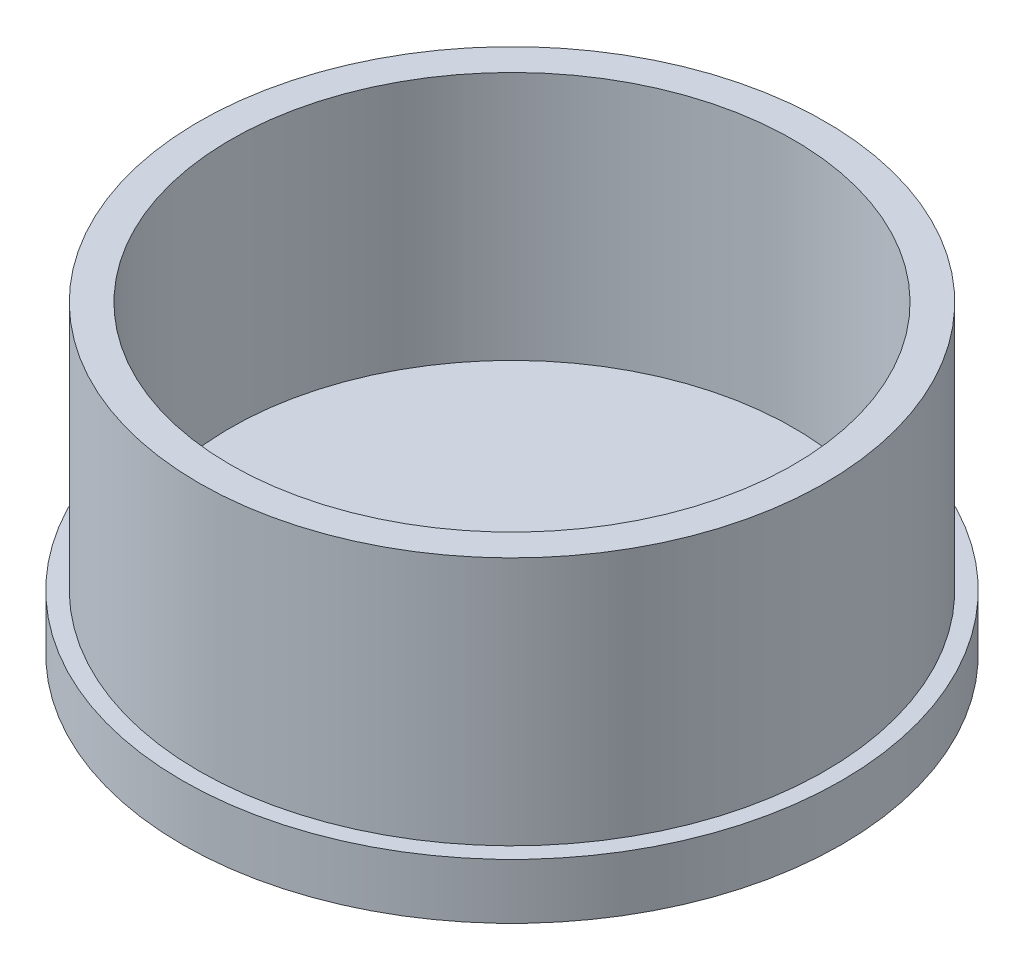
ISO-10303-21;
HEADER;
FILE_DESCRIPTION(('STEP AP214'),'2;1');
FILE_NAME('part.step','',(''),(''),'','','');
FILE_SCHEMA(('AUTOMOTIVE_DESIGN { 1 0 10303 214 1 1 1 1 }'));
ENDSEC;
DATA;
#1=APPLICATION_CONTEXT('core data for automotive mechanical design processes');
#2=APPLICATION_PROTOCOL_DEFINITION('international standard','automotive_design',2000,#1);
#3=PRODUCT_CONTEXT('',#1,'mechanical');
#4=PRODUCT('Part','Part','',(#3));
#5=PRODUCT_RELATED_PRODUCT_CATEGORY('part','',(#4));
#6=PRODUCT_DEFINITION_FORMATION('','',#4);
#7=PRODUCT_DEFINITION_CONTEXT('part definition',#1,'design');
#8=PRODUCT_DEFINITION('design','',#6,#7);
#9=PRODUCT_DEFINITION_SHAPE('','',#8);
#10=(LENGTH_UNIT() NAMED_UNIT(*) SI_UNIT(.MILLI.,.METRE.));
#11=(NAMED_UNIT(*) PLANE_ANGLE_UNIT() SI_UNIT($,.RADIAN.));
#12=(NAMED_UNIT(*) SI_UNIT($,.STERADIAN.) SOLID_ANGLE_UNIT());
#13=UNCERTAINTY_MEASURE_WITH_UNIT(LENGTH_MEASURE(1.E-05),#10,'distance_accuracy_value','');
#14=(GEOMETRIC_REPRESENTATION_CONTEXT(3) GLOBAL_UNCERTAINTY_ASSIGNED_CONTEXT((#13)) GLOBAL_UNIT_ASSIGNED_CONTEXT((#10,
#11,#12)) REPRESENTATION_CONTEXT('',''));
#15=CARTESIAN_POINT('',(0.,0.,0.));
#16=DIRECTION('',(0.,0.,1.));
#17=DIRECTION('',(1.,0.,0.));
#18=AXIS2_PLACEMENT_3D('',#15,#16,#17);
#19=CARTESIAN_POINT('',(0.,55.,0.));
#20=DIRECTION('',(0.,1.,0.));
#21=DIRECTION('',(0.,0.,1.));
#22=AXIS2_PLACEMENT_3D('',#19,#20,#21);
#23=PLANE('',#22);
#24=CARTESIAN_POINT('',(0.,55.,0.));
#25=DIRECTION('',(0.,1.,0.));
#26=DIRECTION('',(0.,0.,1.));
#27=AXIS2_PLACEMENT_3D('',#24,#25,#26);
#28=CIRCLE('',#27,50.8);
#29=CARTESIAN_POINT('',(0.,55.,50.8));
#30=VERTEX_POINT('',#29);
#31=EDGE_CURVE('E50',#30,#30,#28,.T.);
#32=ORIENTED_EDGE('',*,*,#31,.F.);
#33=EDGE_LOOP('',(#32));
#34=FACE_BOUND('',#33,.T.);
#35=CARTESIAN_POINT('',(0.,55.,0.));
#36=DIRECTION('',(0.,1.,0.));
#37=DIRECTION('',(0.,0.,1.));
#38=AXIS2_PLACEMENT_3D('',#35,#36,#37);
#39=CIRCLE('',#38,56.5);
#40=CARTESIAN_POINT('',(0.,55.,56.5));
#41=VERTEX_POINT('',#40);
#42=EDGE_CURVE('E62',#41,#41,#39,.T.);
#43=ORIENTED_EDGE('',*,*,#42,.T.);
#44=EDGE_LOOP('',(#43));
#45=FACE_BOUND('',#44,.T.);
#46=ADVANCED_FACE('F37',(#34,#45),#23,.T.);
#47=CARTESIAN_POINT('',(0.,10.,0.));
#48=DIRECTION('',(0.,1.,0.));
#49=DIRECTION('',(0.,0.,1.));
#50=AXIS2_PLACEMENT_3D('',#47,#48,#49);
#51=CYLINDRICAL_SURFACE('',#50,50.8);
#52=CARTESIAN_POINT('',(0.,10.,0.));
#53=DIRECTION('',(0.,1.,0.));
#54=DIRECTION('',(0.,0.,1.));
#55=AXIS2_PLACEMENT_3D('',#52,#53,#54);
#56=CIRCLE('',#55,50.8);
#57=CARTESIAN_POINT('',(0.,10.,50.8));
#58=VERTEX_POINT('',#57);
#59=EDGE_CURVE('E45',#58,#58,#56,.T.);
#60=ORIENTED_EDGE('',*,*,#59,.F.);
#61=EDGE_LOOP('',(#60));
#62=FACE_BOUND('',#61,.T.);
#63=ORIENTED_EDGE('',*,*,#31,.T.);
#64=EDGE_LOOP('',(#63));
#65=FACE_BOUND('',#64,.T.);
#66=ADVANCED_FACE('F87',(#62,#65),#51,.F.);
#67=CARTESIAN_POINT('',(0.,10.,0.));
#68=DIRECTION('',(0.,1.,0.));
#69=DIRECTION('',(0.,0.,1.));
#70=AXIS2_PLACEMENT_3D('',#67,#68,#69);
#71=PLANE('',#70);
#72=ORIENTED_EDGE('',*,*,#59,.T.);
#73=EDGE_LOOP('',(#72));
#74=FACE_BOUND('',#73,.T.);
#75=ADVANCED_FACE('F76',(#74),#71,.T.);
#76=CARTESIAN_POINT('',(0.,10.,0.));
#77=DIRECTION('',(0.,1.,0.));
#78=DIRECTION('',(0.,0.,1.));
#79=AXIS2_PLACEMENT_3D('',#76,#77,#78);
#80=PLANE('',#79);
#81=CARTESIAN_POINT('',(0.,10.,0.));
#82=DIRECTION('',(0.,1.,0.));
#83=DIRECTION('',(0.,0.,1.));
#84=AXIS2_PLACEMENT_3D('',#81,#82,#83);
#85=CIRCLE('',#84,56.5);
#86=CARTESIAN_POINT('',(0.,10.,56.5));
#87=VERTEX_POINT('',#86);
#88=EDGE_CURVE('E61',#87,#87,#85,.T.);
#89=ORIENTED_EDGE('',*,*,#88,.F.);
#90=EDGE_LOOP('',(#89));
#91=FACE_BOUND('',#90,.T.);
#92=CARTESIAN_POINT('',(0.,10.,0.));
#93=DIRECTION('',(0.,1.,0.));
#94=DIRECTION('',(0.,0.,1.));
#95=AXIS2_PLACEMENT_3D('',#92,#93,#94);
#96=CIRCLE('',#95,59.5);
#97=CARTESIAN_POINT('',(0.,10.,59.5));
#98=VERTEX_POINT('',#97);
#99=EDGE_CURVE('E56',#98,#98,#96,.T.);
#100=ORIENTED_EDGE('',*,*,#99,.T.);
#101=EDGE_LOOP('',(#100));
#102=FACE_BOUND('',#101,.T.);
#103=ADVANCED_FACE('F73',(#91,#102),#80,.T.);
#104=CARTESIAN_POINT('',(0.,10.,0.));
#105=DIRECTION('',(0.,1.,0.));
#106=DIRECTION('',(0.,0.,1.));
#107=AXIS2_PLACEMENT_3D('',#104,#105,#106);
#108=CYLINDRICAL_SURFACE('',#107,56.5);
#109=ORIENTED_EDGE('',*,*,#88,.T.);
#110=EDGE_LOOP('',(#109));
#111=FACE_BOUND('',#110,.T.);
#112=ORIENTED_EDGE('',*,*,#42,.F.);
#113=EDGE_LOOP('',(#112));
#114=FACE_BOUND('',#113,.T.);
#115=ADVANCED_FACE('F70',(#111,#114),#108,.T.);
#116=CARTESIAN_POINT('',(0.,0.,0.));
#117=DIRECTION('',(0.,1.,0.));
#118=DIRECTION('',(0.,0.,1.));
#119=AXIS2_PLACEMENT_3D('',#116,#117,#118);
#120=PLANE('',#119);
#121=CARTESIAN_POINT('',(0.,0.,0.));
#122=DIRECTION('',(0.,1.,0.));
#123=DIRECTION('',(0.,0.,1.));
#124=AXIS2_PLACEMENT_3D('',#121,#122,#123);
#125=CIRCLE('',#124,59.5);
#126=CARTESIAN_POINT('',(0.,0.,59.5));
#127=VERTEX_POINT('',#126);
#128=EDGE_CURVE('E10',#127,#127,#125,.T.);
#129=ORIENTED_EDGE('',*,*,#128,.F.);
#130=EDGE_LOOP('',(#129));
#131=FACE_BOUND('',#130,.T.);
#132=ADVANCED_FACE('F81',(#131),#120,.F.);
#133=CARTESIAN_POINT('',(0.,55.,0.));
#134=DIRECTION('',(0.,-1.,0.));
#135=DIRECTION('',(0.,0.,-1.));
#136=AXIS2_PLACEMENT_3D('',#133,#134,#135);
#137=CYLINDRICAL_SURFACE('',#136,59.5);
#138=ORIENTED_EDGE('',*,*,#128,.T.);
#139=EDGE_LOOP('',(#138));
#140=FACE_BOUND('',#139,.T.);
#141=ORIENTED_EDGE('',*,*,#99,.F.);
#142=EDGE_LOOP('',(#141));
#143=FACE_BOUND('',#142,.T.);
#144=ADVANCED_FACE('F39',(#140,#143),#137,.T.);
#145=CLOSED_SHELL('',(#46,#66,#75,#103,#115,#132,#144));
#146=MANIFOLD_SOLID_BREP('B2',#145);
#147=ADVANCED_BREP_SHAPE_REPRESENTATION('',(#18,#146),#14);
#148=SHAPE_DEFINITION_REPRESENTATION(#9,#147);
ENDSEC;
END-ISO-10303-21;
